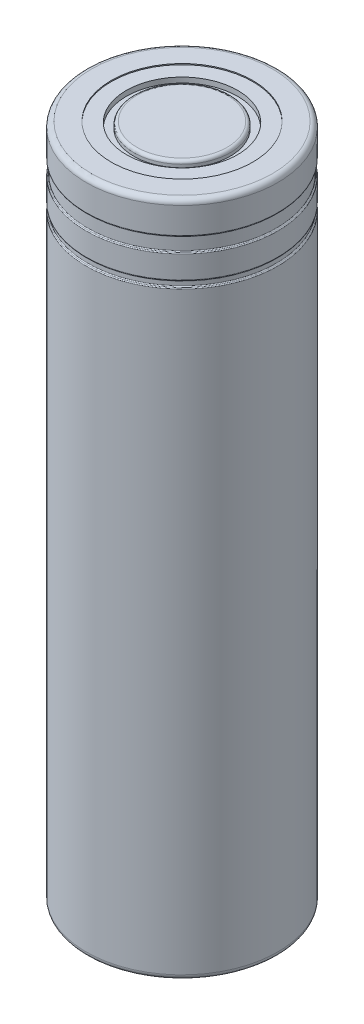
ISO-10303-21;
HEADER;
FILE_DESCRIPTION(('STEP AP214'),'2;1');
FILE_NAME('part.step','',(''),(''),'','','');
FILE_SCHEMA(('AUTOMOTIVE_DESIGN { 1 0 10303 214 1 1 1 1 }'));
ENDSEC;
DATA;
#1=APPLICATION_CONTEXT('core data for automotive mechanical design processes');
#2=APPLICATION_PROTOCOL_DEFINITION('international standard','automotive_design',2000,#1);
#3=PRODUCT_CONTEXT('',#1,'mechanical');
#4=PRODUCT('Part','Part','',(#3));
#5=PRODUCT_RELATED_PRODUCT_CATEGORY('part','',(#4));
#6=PRODUCT_DEFINITION_FORMATION('','',#4);
#7=PRODUCT_DEFINITION_CONTEXT('part definition',#1,'design');
#8=PRODUCT_DEFINITION('design','',#6,#7);
#9=PRODUCT_DEFINITION_SHAPE('','',#8);
#10=(LENGTH_UNIT() NAMED_UNIT(*) SI_UNIT(.MILLI.,.METRE.));
#11=(NAMED_UNIT(*) PLANE_ANGLE_UNIT() SI_UNIT($,.RADIAN.));
#12=(NAMED_UNIT(*) SI_UNIT($,.STERADIAN.) SOLID_ANGLE_UNIT());
#13=UNCERTAINTY_MEASURE_WITH_UNIT(LENGTH_MEASURE(1.E-05),#10,'distance_accuracy_value','');
#14=(GEOMETRIC_REPRESENTATION_CONTEXT(3) GLOBAL_UNCERTAINTY_ASSIGNED_CONTEXT((#13)) GLOBAL_UNIT_ASSIGNED_CONTEXT((#10,
#11,#12)) REPRESENTATION_CONTEXT('',''));
#15=CARTESIAN_POINT('',(0.,0.,0.));
#16=DIRECTION('',(0.,0.,1.));
#17=DIRECTION('',(1.,0.,0.));
#18=AXIS2_PLACEMENT_3D('',#15,#16,#17);
#19=CARTESIAN_POINT('',(0.,64.9,0.));
#20=DIRECTION('',(0.,-1.,0.));
#21=DIRECTION('',(1.,0.,0.));
#22=AXIS2_PLACEMENT_3D('',#19,#20,#21);
#23=PLANE('',#22);
#24=CARTESIAN_POINT('',(0.,64.9,0.));
#25=DIRECTION('',(0.,1.,0.));
#26=DIRECTION('',(-1.,0.,0.));
#27=AXIS2_PLACEMENT_3D('',#24,#25,#26);
#28=CIRCLE('',#27,8.7);
#29=CARTESIAN_POINT('',(8.69999999999999,64.9,0.));
#30=VERTEX_POINT('',#29);
#31=CARTESIAN_POINT('',(-8.70000000000002,64.9,0.));
#32=VERTEX_POINT('',#31);
#33=EDGE_CURVE('P0_E58',#30,#32,#28,.F.);
#34=ORIENTED_EDGE('',*,*,#33,.T.);
#35=CARTESIAN_POINT('',(0.,64.9,0.));
#36=DIRECTION('',(0.,1.,0.));
#37=DIRECTION('',(1.,0.,0.));
#38=AXIS2_PLACEMENT_3D('',#35,#36,#37);
#39=CIRCLE('',#38,8.7);
#40=EDGE_CURVE('P0_E55',#32,#30,#39,.F.);
#41=ORIENTED_EDGE('',*,*,#40,.T.);
#42=EDGE_LOOP('',(#34,#41));
#43=FACE_BOUND('',#42,.T.);
#44=CARTESIAN_POINT('',(0.,64.9,0.));
#45=DIRECTION('',(0.,1.,0.));
#46=DIRECTION('',(-1.,0.,0.));
#47=AXIS2_PLACEMENT_3D('',#44,#45,#46);
#48=CIRCLE('',#47,6.80000000000001);
#49=CARTESIAN_POINT('',(-6.80000000000003,64.9,0.));
#50=VERTEX_POINT('',#49);
#51=EDGE_CURVE('P0_E63',#50,#50,#48,.T.);
#52=ORIENTED_EDGE('',*,*,#51,.T.);
#53=EDGE_LOOP('',(#52));
#54=FACE_BOUND('',#53,.T.);
#55=ADVANCED_FACE('P0_F15',(#43,#54),#23,.T.);
#56=CARTESIAN_POINT('',(0.,64.5,0.));
#57=DIRECTION('',(0.,1.,0.));
#58=DIRECTION('',(-1.,0.,0.));
#59=AXIS2_PLACEMENT_3D('',#56,#57,#58);
#60=TOROIDAL_SURFACE('',#59,8.7,0.399999999999999);
#61=CARTESIAN_POINT('',(0.,64.5,0.));
#62=DIRECTION('',(0.,1.,0.));
#63=DIRECTION('',(-1.,0.,0.));
#64=AXIS2_PLACEMENT_3D('',#61,#62,#63);
#65=CIRCLE('',#64,9.1);
#66=CARTESIAN_POINT('',(-9.10000000000002,64.5,0.));
#67=VERTEX_POINT('',#66);
#68=EDGE_CURVE('P0_E142',#67,#67,#65,.F.);
#69=ORIENTED_EDGE('',*,*,#68,.T.);
#70=EDGE_LOOP('',(#69));
#71=FACE_BOUND('',#70,.T.);
#72=ORIENTED_EDGE('',*,*,#40,.F.);
#73=ORIENTED_EDGE('',*,*,#33,.F.);
#74=EDGE_LOOP('',(#72,#73));
#75=FACE_BOUND('',#74,.T.);
#76=ADVANCED_FACE('P0_F66',(#71,#75),#60,.F.);
#77=CARTESIAN_POINT('',(0.,0.,0.));
#78=DIRECTION('',(0.,1.,0.));
#79=DIRECTION('',(-1.,0.,0.));
#80=AXIS2_PLACEMENT_3D('',#77,#78,#79);
#81=CYLINDRICAL_SURFACE('',#80,6.80000000000001);
#82=ORIENTED_EDGE('',*,*,#51,.F.);
#83=EDGE_LOOP('',(#82));
#84=FACE_BOUND('',#83,.T.);
#85=CARTESIAN_POINT('',(0.,65.,0.));
#86=DIRECTION('',(0.,1.,0.));
#87=DIRECTION('',(-1.,0.,0.));
#88=AXIS2_PLACEMENT_3D('',#85,#86,#87);
#89=CIRCLE('',#88,6.80000000000001);
#90=CARTESIAN_POINT('',(-6.80000000000003,65.,0.));
#91=VERTEX_POINT('',#90);
#92=EDGE_CURVE('P0_E144',#91,#91,#89,.T.);
#93=ORIENTED_EDGE('',*,*,#92,.T.);
#94=EDGE_LOOP('',(#93));
#95=FACE_BOUND('',#94,.T.);
#96=ADVANCED_FACE('P0_F148',(#84,#95),#81,.F.);
#97=CARTESIAN_POINT('',(0.,0.,0.));
#98=DIRECTION('',(0.,1.,0.));
#99=DIRECTION('',(-1.,0.,0.));
#100=AXIS2_PLACEMENT_3D('',#97,#98,#99);
#101=CYLINDRICAL_SURFACE('',#100,9.1);
#102=CARTESIAN_POINT('',(0.,61.9999999999998,0.));
#103=DIRECTION('',(0.,1.,0.));
#104=DIRECTION('',(-1.,0.,0.));
#105=AXIS2_PLACEMENT_3D('',#102,#103,#104);
#106=CIRCLE('',#105,9.10000000000007);
#107=CARTESIAN_POINT('',(-9.10000000000008,61.9999999999998,0.));
#108=VERTEX_POINT('',#107);
#109=EDGE_CURVE('P0_E134',#108,#108,#106,.T.);
#110=ORIENTED_EDGE('',*,*,#109,.F.);
#111=EDGE_LOOP('',(#110));
#112=FACE_BOUND('',#111,.T.);
#113=ORIENTED_EDGE('',*,*,#68,.F.);
#114=EDGE_LOOP('',(#113));
#115=FACE_BOUND('',#114,.T.);
#116=ADVANCED_FACE('P0_F120',(#112,#115),#101,.F.);
#117=CARTESIAN_POINT('',(0.,65.,0.));
#118=DIRECTION('',(0.,-1.,0.));
#119=DIRECTION('',(1.,0.,0.));
#120=AXIS2_PLACEMENT_3D('',#117,#118,#119);
#121=PLANE('',#120);
#122=CARTESIAN_POINT('',(0.,65.,0.));
#123=DIRECTION('',(0.,-1.,0.));
#124=DIRECTION('',(-1.,0.,0.));
#125=AXIS2_PLACEMENT_3D('',#122,#123,#124);
#126=CIRCLE('',#125,8.7);
#127=CARTESIAN_POINT('',(-8.70000000000002,65.,0.));
#128=VERTEX_POINT('',#127);
#129=CARTESIAN_POINT('',(8.69999999999999,65.,0.));
#130=VERTEX_POINT('',#129);
#131=EDGE_CURVE('P0_E105',#128,#130,#126,.T.);
#132=ORIENTED_EDGE('',*,*,#131,.F.);
#133=CARTESIAN_POINT('',(0.,65.,0.));
#134=DIRECTION('',(0.,-1.,0.));
#135=DIRECTION('',(1.,0.,0.));
#136=AXIS2_PLACEMENT_3D('',#133,#134,#135);
#137=CIRCLE('',#136,8.7);
#138=EDGE_CURVE('P0_E99',#130,#128,#137,.T.);
#139=ORIENTED_EDGE('',*,*,#138,.F.);
#140=EDGE_LOOP('',(#132,#139));
#141=FACE_BOUND('',#140,.T.);
#142=ORIENTED_EDGE('',*,*,#92,.F.);
#143=EDGE_LOOP('',(#142));
#144=FACE_BOUND('',#143,.T.);
#145=ADVANCED_FACE('P0_F111',(#141,#144),#121,.F.);
#146=CARTESIAN_POINT('',(0.,61.8092121597162,0.));
#147=DIRECTION('',(0.,1.,0.));
#148=DIRECTION('',(-1.,0.,0.));
#149=AXIS2_PLACEMENT_3D('',#146,#147,#148);
#150=TOROIDAL_SURFACE('',#149,9.1600000000003,0.200000000000288);
#151=CARTESIAN_POINT('',(0.,61.8092121597162,0.));
#152=DIRECTION('',(0.,1.,0.));
#153=DIRECTION('',(-1.,0.,0.));
#154=AXIS2_PLACEMENT_3D('',#151,#152,#153);
#155=CIRCLE('',#154,8.96000000000001);
#156=CARTESIAN_POINT('',(-8.96000000000002,61.8092121597162,0.));
#157=VERTEX_POINT('',#156);
#158=EDGE_CURVE('P0_E97',#157,#157,#155,.F.);
#159=ORIENTED_EDGE('',*,*,#158,.T.);
#160=EDGE_LOOP('',(#159));
#161=FACE_BOUND('',#160,.T.);
#162=ORIENTED_EDGE('',*,*,#109,.T.);
#163=EDGE_LOOP('',(#162));
#164=FACE_BOUND('',#163,.T.);
#165=ADVANCED_FACE('P0_F85',(#161,#164),#150,.T.);
#166=CARTESIAN_POINT('',(0.,64.5,0.));
#167=DIRECTION('',(0.,1.,0.));
#168=DIRECTION('',(-1.,0.,0.));
#169=AXIS2_PLACEMENT_3D('',#166,#167,#168);
#170=TOROIDAL_SURFACE('',#169,8.7,0.500000000000001);
#171=ORIENTED_EDGE('',*,*,#131,.T.);
#172=ORIENTED_EDGE('',*,*,#138,.T.);
#173=EDGE_LOOP('',(#171,#172));
#174=FACE_BOUND('',#173,.T.);
#175=CARTESIAN_POINT('',(0.,64.5,0.));
#176=DIRECTION('',(0.,1.,0.));
#177=DIRECTION('',(-1.,0.,0.));
#178=AXIS2_PLACEMENT_3D('',#175,#176,#177);
#179=CIRCLE('',#178,9.20000000000001);
#180=CARTESIAN_POINT('',(-9.20000000000002,64.5,0.));
#181=VERTEX_POINT('',#180);
#182=EDGE_CURVE('P0_E95',#181,#181,#179,.F.);
#183=ORIENTED_EDGE('',*,*,#182,.F.);
#184=EDGE_LOOP('',(#183));
#185=FACE_BOUND('',#184,.T.);
#186=ADVANCED_FACE('P0_F73',(#174,#185),#170,.T.);
#187=CARTESIAN_POINT('',(0.,0.,0.));
#188=DIRECTION('',(0.,1.,0.));
#189=DIRECTION('',(-1.,0.,0.));
#190=AXIS2_PLACEMENT_3D('',#187,#188,#189);
#191=CYLINDRICAL_SURFACE('',#190,8.96000000000001);
#192=CARTESIAN_POINT('',(0.,60.6507878402838,0.));
#193=DIRECTION('',(0.,1.,0.));
#194=DIRECTION('',(-1.,0.,0.));
#195=AXIS2_PLACEMENT_3D('',#192,#193,#194);
#196=CIRCLE('',#195,8.96000000000001);
#197=CARTESIAN_POINT('',(-8.96000000000003,60.6507878402838,0.));
#198=VERTEX_POINT('',#197);
#199=EDGE_CURVE('P0_E372',#198,#198,#196,.T.);
#200=ORIENTED_EDGE('',*,*,#199,.F.);
#201=EDGE_LOOP('',(#200));
#202=FACE_BOUND('',#201,.T.);
#203=ORIENTED_EDGE('',*,*,#158,.F.);
#204=EDGE_LOOP('',(#203));
#205=FACE_BOUND('',#204,.T.);
#206=ADVANCED_FACE('P0_F84',(#202,#205),#191,.F.);
#207=CARTESIAN_POINT('',(0.,0.,0.));
#208=DIRECTION('',(0.,1.,0.));
#209=DIRECTION('',(-1.,0.,0.));
#210=AXIS2_PLACEMENT_3D('',#207,#208,#209);
#211=CYLINDRICAL_SURFACE('',#210,9.20000000000001);
#212=ORIENTED_EDGE('',*,*,#182,.T.);
#213=EDGE_LOOP('',(#212));
#214=FACE_BOUND('',#213,.T.);
#215=CARTESIAN_POINT('',(0.,62.,0.));
#216=DIRECTION('',(0.,1.,0.));
#217=DIRECTION('',(-1.,0.,0.));
#218=AXIS2_PLACEMENT_3D('',#215,#216,#217);
#219=CIRCLE('',#218,9.2);
#220=CARTESIAN_POINT('',(-9.20000000000002,62.,0.));
#221=VERTEX_POINT('',#220);
#222=EDGE_CURVE('P0_E370',#221,#221,#219,.F.);
#223=ORIENTED_EDGE('',*,*,#222,.F.);
#224=EDGE_LOOP('',(#223));
#225=FACE_BOUND('',#224,.T.);
#226=ADVANCED_FACE('P0_F366',(#214,#225),#211,.T.);
#227=CARTESIAN_POINT('',(0.,60.6507878402838,0.));
#228=DIRECTION('',(0.,1.,0.));
#229=DIRECTION('',(-1.,0.,0.));
#230=AXIS2_PLACEMENT_3D('',#227,#228,#229);
#231=TOROIDAL_SURFACE('',#230,9.1600000000003,0.200000000000286);
#232=CARTESIAN_POINT('',(0.,60.46,0.));
#233=DIRECTION('',(0.,1.,0.));
#234=DIRECTION('',(-1.,0.,0.));
#235=AXIS2_PLACEMENT_3D('',#232,#233,#234);
#236=CIRCLE('',#235,9.10000000000001);
#237=CARTESIAN_POINT('',(-9.10000000000002,60.46,0.));
#238=VERTEX_POINT('',#237);
#239=EDGE_CURVE('P0_E356',#238,#238,#236,.F.);
#240=ORIENTED_EDGE('',*,*,#239,.T.);
#241=EDGE_LOOP('',(#240));
#242=FACE_BOUND('',#241,.T.);
#243=ORIENTED_EDGE('',*,*,#199,.T.);
#244=EDGE_LOOP('',(#243));
#245=FACE_BOUND('',#244,.T.);
#246=ADVANCED_FACE('P0_F363',(#242,#245),#231,.T.);
#247=CARTESIAN_POINT('',(0.,62.,0.));
#248=DIRECTION('',(0.,1.,0.));
#249=DIRECTION('',(-1.,0.,0.));
#250=AXIS2_PLACEMENT_3D('',#247,#248,#249);
#251=TOROIDAL_SURFACE('',#250,9.09999999999972,0.100000000000288);
#252=ORIENTED_EDGE('',*,*,#222,.T.);
#253=EDGE_LOOP('',(#252));
#254=FACE_BOUND('',#253,.T.);
#255=CARTESIAN_POINT('',(0.,61.9046060798581,0.));
#256=DIRECTION('',(0.,1.,0.));
#257=DIRECTION('',(-1.,0.,0.));
#258=AXIS2_PLACEMENT_3D('',#255,#256,#257);
#259=CIRCLE('',#258,9.13000000000001);
#260=CARTESIAN_POINT('',(-9.13000000000003,61.9046060798581,0.));
#261=VERTEX_POINT('',#260);
#262=EDGE_CURVE('P0_E353',#261,#261,#259,.T.);
#263=ORIENTED_EDGE('',*,*,#262,.T.);
#264=EDGE_LOOP('',(#263));
#265=FACE_BOUND('',#264,.T.);
#266=ADVANCED_FACE('P0_F360',(#254,#265),#251,.T.);
#267=CARTESIAN_POINT('',(0.,0.,0.));
#268=DIRECTION('',(0.,1.,0.));
#269=DIRECTION('',(-1.,0.,0.));
#270=AXIS2_PLACEMENT_3D('',#267,#268,#269);
#271=CYLINDRICAL_SURFACE('',#270,9.10000000000001);
#272=CARTESIAN_POINT('',(0.,58.2999999999998,0.));
#273=DIRECTION('',(0.,1.,0.));
#274=DIRECTION('',(-1.,0.,0.));
#275=AXIS2_PLACEMENT_3D('',#272,#273,#274);
#276=CIRCLE('',#275,9.10000000000007);
#277=CARTESIAN_POINT('',(-9.10000000000008,58.2999999999998,0.));
#278=VERTEX_POINT('',#277);
#279=EDGE_CURVE('P0_E350',#278,#278,#276,.T.);
#280=ORIENTED_EDGE('',*,*,#279,.F.);
#281=EDGE_LOOP('',(#280));
#282=FACE_BOUND('',#281,.T.);
#283=ORIENTED_EDGE('',*,*,#239,.F.);
#284=EDGE_LOOP('',(#283));
#285=FACE_BOUND('',#284,.T.);
#286=ADVANCED_FACE('P0_F345',(#282,#285),#271,.F.);
#287=CARTESIAN_POINT('',(0.,61.8092121597162,0.));
#288=DIRECTION('',(0.,1.,0.));
#289=DIRECTION('',(-1.,0.,0.));
#290=AXIS2_PLACEMENT_3D('',#287,#288,#289);
#291=TOROIDAL_SURFACE('',#290,9.1600000000003,0.100000000000288);
#292=ORIENTED_EDGE('',*,*,#262,.F.);
#293=EDGE_LOOP('',(#292));
#294=FACE_BOUND('',#293,.T.);
#295=CARTESIAN_POINT('',(0.,61.8092121597162,0.));
#296=DIRECTION('',(0.,1.,0.));
#297=DIRECTION('',(-1.,0.,0.));
#298=AXIS2_PLACEMENT_3D('',#295,#296,#297);
#299=CIRCLE('',#298,9.06000000000001);
#300=CARTESIAN_POINT('',(-9.06000000000003,61.8092121597162,0.));
#301=VERTEX_POINT('',#300);
#302=EDGE_CURVE('P0_E331',#301,#301,#299,.F.);
#303=ORIENTED_EDGE('',*,*,#302,.F.);
#304=EDGE_LOOP('',(#303));
#305=FACE_BOUND('',#304,.T.);
#306=ADVANCED_FACE('P0_F341',(#294,#305),#291,.F.);
#307=CARTESIAN_POINT('',(0.,58.1092121597162,0.));
#308=DIRECTION('',(0.,1.,0.));
#309=DIRECTION('',(-1.,0.,0.));
#310=AXIS2_PLACEMENT_3D('',#307,#308,#309);
#311=TOROIDAL_SURFACE('',#310,9.1600000000003,0.200000000000295);
#312=CARTESIAN_POINT('',(0.,58.1092121597162,0.));
#313=DIRECTION('',(0.,1.,0.));
#314=DIRECTION('',(-1.,0.,0.));
#315=AXIS2_PLACEMENT_3D('',#312,#313,#314);
#316=CIRCLE('',#315,8.96000000000001);
#317=CARTESIAN_POINT('',(-8.96000000000002,58.1092121597162,0.));
#318=VERTEX_POINT('',#317);
#319=EDGE_CURVE('P0_E328',#318,#318,#316,.F.);
#320=ORIENTED_EDGE('',*,*,#319,.T.);
#321=EDGE_LOOP('',(#320));
#322=FACE_BOUND('',#321,.T.);
#323=ORIENTED_EDGE('',*,*,#279,.T.);
#324=EDGE_LOOP('',(#323));
#325=FACE_BOUND('',#324,.T.);
#326=ADVANCED_FACE('P0_F336',(#322,#325),#311,.T.);
#327=CARTESIAN_POINT('',(0.,0.,0.));
#328=DIRECTION('',(0.,1.,0.));
#329=DIRECTION('',(-1.,0.,0.));
#330=AXIS2_PLACEMENT_3D('',#327,#328,#329);
#331=CYLINDRICAL_SURFACE('',#330,9.06000000000001);
#332=ORIENTED_EDGE('',*,*,#302,.T.);
#333=EDGE_LOOP('',(#332));
#334=FACE_BOUND('',#333,.T.);
#335=CARTESIAN_POINT('',(0.,60.6507878402838,0.));
#336=DIRECTION('',(0.,1.,0.));
#337=DIRECTION('',(-1.,0.,0.));
#338=AXIS2_PLACEMENT_3D('',#335,#336,#337);
#339=CIRCLE('',#338,9.06000000000001);
#340=CARTESIAN_POINT('',(-9.06000000000003,60.6507878402838,0.));
#341=VERTEX_POINT('',#340);
#342=EDGE_CURVE('P0_E325',#341,#341,#339,.T.);
#343=ORIENTED_EDGE('',*,*,#342,.T.);
#344=EDGE_LOOP('',(#343));
#345=FACE_BOUND('',#344,.T.);
#346=ADVANCED_FACE('P0_F340',(#334,#345),#331,.T.);
#347=CARTESIAN_POINT('',(0.,0.,0.));
#348=DIRECTION('',(0.,1.,0.));
#349=DIRECTION('',(-1.,0.,0.));
#350=AXIS2_PLACEMENT_3D('',#347,#348,#349);
#351=CYLINDRICAL_SURFACE('',#350,8.96000000000001);
#352=CARTESIAN_POINT('',(0.,57.7307878402838,0.));
#353=DIRECTION('',(0.,1.,0.));
#354=DIRECTION('',(-1.,0.,0.));
#355=AXIS2_PLACEMENT_3D('',#352,#353,#354);
#356=CIRCLE('',#355,8.96000000000001);
#357=CARTESIAN_POINT('',(-8.96000000000002,57.7307878402838,0.));
#358=VERTEX_POINT('',#357);
#359=EDGE_CURVE('P0_E320',#358,#358,#356,.T.);
#360=ORIENTED_EDGE('',*,*,#359,.F.);
#361=EDGE_LOOP('',(#360));
#362=FACE_BOUND('',#361,.T.);
#363=ORIENTED_EDGE('',*,*,#319,.F.);
#364=EDGE_LOOP('',(#363));
#365=FACE_BOUND('',#364,.T.);
#366=ADVANCED_FACE('P0_F391',(#362,#365),#351,.F.);
#367=CARTESIAN_POINT('',(0.,60.6507878402838,0.));
#368=DIRECTION('',(0.,1.,0.));
#369=DIRECTION('',(-1.,0.,0.));
#370=AXIS2_PLACEMENT_3D('',#367,#368,#369);
#371=TOROIDAL_SURFACE('',#370,9.1600000000003,0.100000000000287);
#372=ORIENTED_EDGE('',*,*,#342,.F.);
#373=EDGE_LOOP('',(#372));
#374=FACE_BOUND('',#373,.T.);
#375=CARTESIAN_POINT('',(0.,60.5553939201419,0.));
#376=DIRECTION('',(0.,1.,0.));
#377=DIRECTION('',(-1.,0.,0.));
#378=AXIS2_PLACEMENT_3D('',#375,#376,#377);
#379=CIRCLE('',#378,9.13000000000001);
#380=CARTESIAN_POINT('',(-9.13000000000003,60.5553939201419,0.));
#381=VERTEX_POINT('',#380);
#382=EDGE_CURVE('P0_E318',#381,#381,#379,.F.);
#383=ORIENTED_EDGE('',*,*,#382,.F.);
#384=EDGE_LOOP('',(#383));
#385=FACE_BOUND('',#384,.T.);
#386=ADVANCED_FACE('P0_F312',(#374,#385),#371,.F.);
#387=CARTESIAN_POINT('',(0.,57.7307878402838,0.));
#388=DIRECTION('',(0.,1.,0.));
#389=DIRECTION('',(-1.,0.,0.));
#390=AXIS2_PLACEMENT_3D('',#387,#388,#389);
#391=TOROIDAL_SURFACE('',#390,9.16000000000031,0.200000000000297);
#392=CARTESIAN_POINT('',(0.,57.54,0.));
#393=DIRECTION('',(0.,1.,0.));
#394=DIRECTION('',(-1.,0.,0.));
#395=AXIS2_PLACEMENT_3D('',#392,#393,#394);
#396=CIRCLE('',#395,9.1);
#397=CARTESIAN_POINT('',(-9.10000000000001,57.54,0.));
#398=VERTEX_POINT('',#397);
#399=EDGE_CURVE('P0_E297',#398,#398,#396,.F.);
#400=ORIENTED_EDGE('',*,*,#399,.T.);
#401=EDGE_LOOP('',(#400));
#402=FACE_BOUND('',#401,.T.);
#403=ORIENTED_EDGE('',*,*,#359,.T.);
#404=EDGE_LOOP('',(#403));
#405=FACE_BOUND('',#404,.T.);
#406=ADVANCED_FACE('P0_F307',(#402,#405),#391,.T.);
#407=CARTESIAN_POINT('',(0.,60.46,0.));
#408=DIRECTION('',(0.,1.,0.));
#409=DIRECTION('',(-1.,0.,0.));
#410=AXIS2_PLACEMENT_3D('',#407,#408,#409);
#411=TOROIDAL_SURFACE('',#410,9.09999999999972,0.100000000000289);
#412=ORIENTED_EDGE('',*,*,#382,.T.);
#413=EDGE_LOOP('',(#412));
#414=FACE_BOUND('',#413,.T.);
#415=CARTESIAN_POINT('',(0.,60.46,0.));
#416=DIRECTION('',(0.,1.,0.));
#417=DIRECTION('',(-1.,0.,0.));
#418=AXIS2_PLACEMENT_3D('',#415,#416,#417);
#419=CIRCLE('',#418,9.20000000000001);
#420=CARTESIAN_POINT('',(-9.20000000000002,60.46,0.));
#421=VERTEX_POINT('',#420);
#422=EDGE_CURVE('P0_E289',#421,#421,#419,.F.);
#423=ORIENTED_EDGE('',*,*,#422,.F.);
#424=EDGE_LOOP('',(#423));
#425=FACE_BOUND('',#424,.T.);
#426=ADVANCED_FACE('P0_F302',(#414,#425),#411,.T.);
#427=CARTESIAN_POINT('',(0.,0.,0.));
#428=DIRECTION('',(0.,1.,0.));
#429=DIRECTION('',(-1.,0.,0.));
#430=AXIS2_PLACEMENT_3D('',#427,#428,#429);
#431=CYLINDRICAL_SURFACE('',#430,9.1);
#432=CARTESIAN_POINT('',(0.,0.499999999999998,0.));
#433=DIRECTION('',(0.,1.,0.));
#434=DIRECTION('',(-1.,0.,0.));
#435=AXIS2_PLACEMENT_3D('',#432,#433,#434);
#436=CIRCLE('',#435,9.09999999999999);
#437=CARTESIAN_POINT('',(-9.09999999999999,0.499999999999996,0.));
#438=VERTEX_POINT('',#437);
#439=EDGE_CURVE('P0_E284',#438,#438,#436,.F.);
#440=ORIENTED_EDGE('',*,*,#439,.T.);
#441=EDGE_LOOP('',(#440));
#442=FACE_BOUND('',#441,.T.);
#443=ORIENTED_EDGE('',*,*,#399,.F.);
#444=EDGE_LOOP('',(#443));
#445=FACE_BOUND('',#444,.T.);
#446=ADVANCED_FACE('P0_F306',(#442,#445),#431,.F.);
#447=CARTESIAN_POINT('',(0.,0.,0.));
#448=DIRECTION('',(0.,1.,0.));
#449=DIRECTION('',(-1.,0.,0.));
#450=AXIS2_PLACEMENT_3D('',#447,#448,#449);
#451=CYLINDRICAL_SURFACE('',#450,9.20000000000001);
#452=ORIENTED_EDGE('',*,*,#422,.T.);
#453=EDGE_LOOP('',(#452));
#454=FACE_BOUND('',#453,.T.);
#455=CARTESIAN_POINT('',(0.,58.3,0.));
#456=DIRECTION('',(0.,1.,0.));
#457=DIRECTION('',(-1.,0.,0.));
#458=AXIS2_PLACEMENT_3D('',#455,#456,#457);
#459=CIRCLE('',#458,9.20000000000001);
#460=CARTESIAN_POINT('',(-9.20000000000002,58.3,0.));
#461=VERTEX_POINT('',#460);
#462=EDGE_CURVE('P0_E282',#461,#461,#459,.F.);
#463=ORIENTED_EDGE('',*,*,#462,.F.);
#464=EDGE_LOOP('',(#463));
#465=FACE_BOUND('',#464,.T.);
#466=ADVANCED_FACE('P0_F400',(#454,#465),#451,.T.);
#467=CARTESIAN_POINT('',(0.,0.499999999999998,0.));
#468=DIRECTION('',(0.,1.,0.));
#469=DIRECTION('',(-1.,0.,0.));
#470=AXIS2_PLACEMENT_3D('',#467,#468,#469);
#471=TOROIDAL_SURFACE('',#470,8.69999999999999,0.4);
#472=CARTESIAN_POINT('',(0.,0.0999999999999988,0.));
#473=DIRECTION('',(0.,-1.,0.));
#474=DIRECTION('',(1.,0.,0.));
#475=AXIS2_PLACEMENT_3D('',#472,#473,#474);
#476=CIRCLE('',#475,8.69999999999999);
#477=CARTESIAN_POINT('',(8.69999999999999,0.100000000000001,0.));
#478=VERTEX_POINT('',#477);
#479=CARTESIAN_POINT('',(-8.69999999999999,0.0999999999999971,0.));
#480=VERTEX_POINT('',#479);
#481=EDGE_CURVE('P0_E276',#478,#480,#476,.T.);
#482=ORIENTED_EDGE('',*,*,#481,.T.);
#483=CARTESIAN_POINT('',(0.,0.0999999999999988,0.));
#484=DIRECTION('',(0.,-1.,0.));
#485=DIRECTION('',(-1.,0.,0.));
#486=AXIS2_PLACEMENT_3D('',#483,#484,#485);
#487=CIRCLE('',#486,8.69999999999999);
#488=EDGE_CURVE('P0_E278',#480,#478,#487,.T.);
#489=ORIENTED_EDGE('',*,*,#488,.T.);
#490=EDGE_LOOP('',(#482,#489));
#491=FACE_BOUND('',#490,.T.);
#492=ORIENTED_EDGE('',*,*,#439,.F.);
#493=EDGE_LOOP('',(#492));
#494=FACE_BOUND('',#493,.T.);
#495=ADVANCED_FACE('P0_F403',(#491,#494),#471,.F.);
#496=CARTESIAN_POINT('',(0.,58.3,0.));
#497=DIRECTION('',(0.,1.,0.));
#498=DIRECTION('',(-1.,0.,0.));
#499=AXIS2_PLACEMENT_3D('',#496,#497,#498);
#500=TOROIDAL_SURFACE('',#499,9.09999999999972,0.100000000000287);
#501=ORIENTED_EDGE('',*,*,#462,.T.);
#502=EDGE_LOOP('',(#501));
#503=FACE_BOUND('',#502,.T.);
#504=CARTESIAN_POINT('',(0.,58.2046060798581,0.));
#505=DIRECTION('',(0.,1.,0.));
#506=DIRECTION('',(-1.,0.,0.));
#507=AXIS2_PLACEMENT_3D('',#504,#505,#506);
#508=CIRCLE('',#507,9.13000000000001);
#509=CARTESIAN_POINT('',(-9.13000000000002,58.2046060798581,0.));
#510=VERTEX_POINT('',#509);
#511=EDGE_CURVE('P0_E169',#510,#510,#508,.T.);
#512=ORIENTED_EDGE('',*,*,#511,.T.);
#513=EDGE_LOOP('',(#512));
#514=FACE_BOUND('',#513,.T.);
#515=ADVANCED_FACE('P0_F258',(#503,#514),#500,.T.);
#516=CARTESIAN_POINT('',(0.,0.0999999999999997,0.));
#517=DIRECTION('',(0.,-1.,0.));
#518=DIRECTION('',(1.,0.,0.));
#519=AXIS2_PLACEMENT_3D('',#516,#517,#518);
#520=PLANE('',#519);
#521=ORIENTED_EDGE('',*,*,#488,.F.);
#522=ORIENTED_EDGE('',*,*,#481,.F.);
#523=EDGE_LOOP('',(#521,#522));
#524=FACE_BOUND('',#523,.T.);
#525=CARTESIAN_POINT('',(0.,0.100000000000003,0.));
#526=DIRECTION('',(0.,1.,0.));
#527=DIRECTION('',(-1.,0.,0.));
#528=AXIS2_PLACEMENT_3D('',#525,#526,#527);
#529=CIRCLE('',#528,7.9);
#530=CARTESIAN_POINT('',(-7.9,0.100000000000001,0.));
#531=VERTEX_POINT('',#530);
#532=EDGE_CURVE('P0_E166',#531,#531,#529,.F.);
#533=ORIENTED_EDGE('',*,*,#532,.T.);
#534=EDGE_LOOP('',(#533));
#535=FACE_BOUND('',#534,.T.);
#536=ADVANCED_FACE('P0_F253',(#524,#535),#520,.F.);
#537=CARTESIAN_POINT('',(0.,58.1092121597162,0.));
#538=DIRECTION('',(0.,1.,0.));
#539=DIRECTION('',(-1.,0.,0.));
#540=AXIS2_PLACEMENT_3D('',#537,#538,#539);
#541=TOROIDAL_SURFACE('',#540,9.1600000000003,0.100000000000291);
#542=ORIENTED_EDGE('',*,*,#511,.F.);
#543=EDGE_LOOP('',(#542));
#544=FACE_BOUND('',#543,.T.);
#545=CARTESIAN_POINT('',(0.,58.1092121597162,0.));
#546=DIRECTION('',(0.,1.,0.));
#547=DIRECTION('',(-1.,0.,0.));
#548=AXIS2_PLACEMENT_3D('',#545,#546,#547);
#549=CIRCLE('',#548,9.06000000000001);
#550=CARTESIAN_POINT('',(-9.06000000000002,58.1092121597162,0.));
#551=VERTEX_POINT('',#550);
#552=EDGE_CURVE('P0_E165',#551,#551,#549,.F.);
#553=ORIENTED_EDGE('',*,*,#552,.F.);
#554=EDGE_LOOP('',(#553));
#555=FACE_BOUND('',#554,.T.);
#556=ADVANCED_FACE('P0_F249',(#544,#555),#541,.F.);
#557=CARTESIAN_POINT('',(0.,0.,0.));
#558=DIRECTION('',(0.,1.,0.));
#559=DIRECTION('',(-1.,0.,0.));
#560=AXIS2_PLACEMENT_3D('',#557,#558,#559);
#561=CYLINDRICAL_SURFACE('',#560,7.9);
#562=ORIENTED_EDGE('',*,*,#532,.F.);
#563=EDGE_LOOP('',(#562));
#564=FACE_BOUND('',#563,.T.);
#565=CARTESIAN_POINT('',(0.,0.,0.));
#566=DIRECTION('',(0.,1.,0.));
#567=DIRECTION('',(-1.,0.,0.));
#568=AXIS2_PLACEMENT_3D('',#565,#566,#567);
#569=CIRCLE('',#568,7.9);
#570=CARTESIAN_POINT('',(-7.9,0.,0.));
#571=VERTEX_POINT('',#570);
#572=EDGE_CURVE('P0_E156',#571,#571,#569,.T.);
#573=ORIENTED_EDGE('',*,*,#572,.F.);
#574=EDGE_LOOP('',(#573));
#575=FACE_BOUND('',#574,.T.);
#576=ADVANCED_FACE('P0_F252',(#564,#575),#561,.F.);
#577=CARTESIAN_POINT('',(0.,0.,0.));
#578=DIRECTION('',(0.,1.,0.));
#579=DIRECTION('',(-1.,0.,0.));
#580=AXIS2_PLACEMENT_3D('',#577,#578,#579);
#581=CYLINDRICAL_SURFACE('',#580,9.06000000000001);
#582=ORIENTED_EDGE('',*,*,#552,.T.);
#583=EDGE_LOOP('',(#582));
#584=FACE_BOUND('',#583,.T.);
#585=CARTESIAN_POINT('',(0.,57.7307878402838,0.));
#586=DIRECTION('',(0.,1.,0.));
#587=DIRECTION('',(-1.,0.,0.));
#588=AXIS2_PLACEMENT_3D('',#585,#586,#587);
#589=CIRCLE('',#588,9.06000000000001);
#590=CARTESIAN_POINT('',(-9.06000000000002,57.7307878402838,0.));
#591=VERTEX_POINT('',#590);
#592=EDGE_CURVE('P0_E164',#591,#591,#589,.T.);
#593=ORIENTED_EDGE('',*,*,#592,.T.);
#594=EDGE_LOOP('',(#593));
#595=FACE_BOUND('',#594,.T.);
#596=ADVANCED_FACE('P0_F221',(#584,#595),#581,.T.);
#597=CARTESIAN_POINT('',(0.,0.,0.));
#598=DIRECTION('',(0.,-1.,0.));
#599=DIRECTION('',(1.,0.,0.));
#600=AXIS2_PLACEMENT_3D('',#597,#598,#599);
#601=PLANE('',#600);
#602=CARTESIAN_POINT('',(0.,0.,0.));
#603=DIRECTION('',(0.,1.,0.));
#604=DIRECTION('',(-1.,0.,0.));
#605=AXIS2_PLACEMENT_3D('',#602,#603,#604);
#606=CIRCLE('',#605,8.69999999999999);
#607=CARTESIAN_POINT('',(-8.69999999999999,0.,0.));
#608=VERTEX_POINT('',#607);
#609=CARTESIAN_POINT('',(8.69999999999999,0.,0.));
#610=VERTEX_POINT('',#609);
#611=EDGE_CURVE('P0_E205',#608,#610,#606,.T.);
#612=ORIENTED_EDGE('',*,*,#611,.F.);
#613=CARTESIAN_POINT('',(0.,0.,0.));
#614=DIRECTION('',(0.,1.,0.));
#615=DIRECTION('',(1.,0.,0.));
#616=AXIS2_PLACEMENT_3D('',#613,#614,#615);
#617=CIRCLE('',#616,8.69999999999999);
#618=EDGE_CURVE('P0_E34',#610,#608,#617,.T.);
#619=ORIENTED_EDGE('',*,*,#618,.F.);
#620=EDGE_LOOP('',(#612,#619));
#621=FACE_BOUND('',#620,.T.);
#622=ORIENTED_EDGE('',*,*,#572,.T.);
#623=EDGE_LOOP('',(#622));
#624=FACE_BOUND('',#623,.T.);
#625=ADVANCED_FACE('P0_F212',(#621,#624),#601,.T.);
#626=CARTESIAN_POINT('',(0.,57.7307878402838,0.));
#627=DIRECTION('',(0.,1.,0.));
#628=DIRECTION('',(-1.,0.,0.));
#629=AXIS2_PLACEMENT_3D('',#626,#627,#628);
#630=TOROIDAL_SURFACE('',#629,9.16000000000031,0.100000000000298);
#631=ORIENTED_EDGE('',*,*,#592,.F.);
#632=EDGE_LOOP('',(#631));
#633=FACE_BOUND('',#632,.T.);
#634=CARTESIAN_POINT('',(0.,57.6353939201419,0.));
#635=DIRECTION('',(0.,1.,0.));
#636=DIRECTION('',(-1.,0.,0.));
#637=AXIS2_PLACEMENT_3D('',#634,#635,#636);
#638=CIRCLE('',#637,9.13000000000001);
#639=CARTESIAN_POINT('',(-9.13000000000003,57.6353939201419,0.));
#640=VERTEX_POINT('',#639);
#641=EDGE_CURVE('P0_E203',#640,#640,#638,.F.);
#642=ORIENTED_EDGE('',*,*,#641,.F.);
#643=EDGE_LOOP('',(#642));
#644=FACE_BOUND('',#643,.T.);
#645=ADVANCED_FACE('P0_F192',(#633,#644),#630,.F.);
#646=CARTESIAN_POINT('',(0.,0.499999999999998,0.));
#647=DIRECTION('',(0.,1.,0.));
#648=DIRECTION('',(-1.,0.,0.));
#649=AXIS2_PLACEMENT_3D('',#646,#647,#648);
#650=TOROIDAL_SURFACE('',#649,8.69999999999999,0.500000000000002);
#651=CARTESIAN_POINT('',(0.,0.499999999999998,0.));
#652=DIRECTION('',(0.,1.,0.));
#653=DIRECTION('',(-1.,0.,0.));
#654=AXIS2_PLACEMENT_3D('',#651,#652,#653);
#655=CIRCLE('',#654,9.2);
#656=CARTESIAN_POINT('',(-9.2,0.499999999999996,0.));
#657=VERTEX_POINT('',#656);
#658=EDGE_CURVE('P0_E26',#657,#657,#655,.T.);
#659=ORIENTED_EDGE('',*,*,#658,.F.);
#660=EDGE_LOOP('',(#659));
#661=FACE_BOUND('',#660,.T.);
#662=ORIENTED_EDGE('',*,*,#611,.T.);
#663=ORIENTED_EDGE('',*,*,#618,.T.);
#664=EDGE_LOOP('',(#662,#663));
#665=FACE_BOUND('',#664,.T.);
#666=ADVANCED_FACE('P0_F180',(#661,#665),#650,.T.);
#667=CARTESIAN_POINT('',(0.,57.54,0.));
#668=DIRECTION('',(0.,1.,0.));
#669=DIRECTION('',(-1.,0.,0.));
#670=AXIS2_PLACEMENT_3D('',#667,#668,#669);
#671=TOROIDAL_SURFACE('',#670,9.09999999999972,0.100000000000288);
#672=ORIENTED_EDGE('',*,*,#641,.T.);
#673=EDGE_LOOP('',(#672));
#674=FACE_BOUND('',#673,.T.);
#675=CARTESIAN_POINT('',(0.,57.54,0.));
#676=DIRECTION('',(0.,1.,0.));
#677=DIRECTION('',(-1.,0.,0.));
#678=AXIS2_PLACEMENT_3D('',#675,#676,#677);
#679=CIRCLE('',#678,9.2);
#680=CARTESIAN_POINT('',(-9.20000000000001,57.54,0.));
#681=VERTEX_POINT('',#680);
#682=EDGE_CURVE('P0_E10',#681,#681,#679,.F.);
#683=ORIENTED_EDGE('',*,*,#682,.F.);
#684=EDGE_LOOP('',(#683));
#685=FACE_BOUND('',#684,.T.);
#686=ADVANCED_FACE('P0_F191',(#674,#685),#671,.T.);
#687=CARTESIAN_POINT('',(0.,0.,0.));
#688=DIRECTION('',(0.,1.,0.));
#689=DIRECTION('',(-1.,0.,0.));
#690=AXIS2_PLACEMENT_3D('',#687,#688,#689);
#691=CYLINDRICAL_SURFACE('',#690,9.2);
#692=ORIENTED_EDGE('',*,*,#682,.T.);
#693=EDGE_LOOP('',(#692));
#694=FACE_BOUND('',#693,.T.);
#695=ORIENTED_EDGE('',*,*,#658,.T.);
#696=EDGE_LOOP('',(#695));
#697=FACE_BOUND('',#696,.T.);
#698=ADVANCED_FACE('P0_F410',(#694,#697),#691,.T.);
#699=CLOSED_SHELL('',(#55,#76,#96,#116,#145,#165,#186,#206,#226,#246,#266,#286,#306,#326,#346,
#366,#386,#406,#426,#446,#466,#495,#515,#536,#556,#576,#596,#625,#645,#666,#686,#698));
#700=MANIFOLD_SOLID_BREP('P0_B1',#699);
#701=CARTESIAN_POINT('',(0.,65.,0.));
#702=DIRECTION('',(0.,-1.,0.));
#703=DIRECTION('',(1.,0.,0.));
#704=AXIS2_PLACEMENT_3D('',#701,#702,#703);
#705=PLANE('',#704);
#706=CARTESIAN_POINT('',(0.,65.,0.));
#707=DIRECTION('',(0.,-1.,0.));
#708=DIRECTION('',(-1.,0.,0.));
#709=AXIS2_PLACEMENT_3D('',#706,#707,#708);
#710=CIRCLE('',#709,4.33000000000002);
#711=CARTESIAN_POINT('',(-4.33000000000003,65.,0.));
#712=VERTEX_POINT('',#711);
#713=CARTESIAN_POINT('',(4.33,65.,0.));
#714=VERTEX_POINT('',#713);
#715=EDGE_CURVE('P1_E49',#712,#714,#710,.T.);
#716=ORIENTED_EDGE('',*,*,#715,.F.);
#717=CARTESIAN_POINT('',(0.,65.,0.));
#718=DIRECTION('',(0.,-1.,0.));
#719=DIRECTION('',(1.,0.,0.));
#720=AXIS2_PLACEMENT_3D('',#717,#718,#719);
#721=CIRCLE('',#720,4.33000000000001);
#722=EDGE_CURVE('P1_E53',#714,#712,#721,.T.);
#723=ORIENTED_EDGE('',*,*,#722,.F.);
#724=EDGE_LOOP('',(#716,#723));
#725=FACE_BOUND('',#724,.T.);
#726=ADVANCED_FACE('P1_F15',(#725),#705,.F.);
#727=CARTESIAN_POINT('',(0.,64.7,0.));
#728=DIRECTION('',(0.,1.,0.));
#729=DIRECTION('',(-1.,0.,0.));
#730=AXIS2_PLACEMENT_3D('',#727,#728,#729);
#731=TOROIDAL_SURFACE('',#730,4.33000000000001,0.299999999999994);
#732=ORIENTED_EDGE('',*,*,#715,.T.);
#733=ORIENTED_EDGE('',*,*,#722,.T.);
#734=EDGE_LOOP('',(#732,#733));
#735=FACE_BOUND('',#734,.T.);
#736=CARTESIAN_POINT('',(0.,64.7,0.));
#737=DIRECTION('',(0.,1.,0.));
#738=DIRECTION('',(-1.,0.,0.));
#739=AXIS2_PLACEMENT_3D('',#736,#737,#738);
#740=CIRCLE('',#739,4.63000000000001);
#741=CARTESIAN_POINT('',(-4.63000000000002,64.7,0.));
#742=VERTEX_POINT('',#741);
#743=EDGE_CURVE('P1_E60',#742,#742,#740,.F.);
#744=ORIENTED_EDGE('',*,*,#743,.F.);
#745=EDGE_LOOP('',(#744));
#746=FACE_BOUND('',#745,.T.);
#747=ADVANCED_FACE('P1_F58',(#735,#746),#731,.T.);
#748=CARTESIAN_POINT('',(0.,0.,0.));
#749=DIRECTION('',(0.,1.,0.));
#750=DIRECTION('',(-1.,0.,0.));
#751=AXIS2_PLACEMENT_3D('',#748,#749,#750);
#752=CYLINDRICAL_SURFACE('',#751,4.63000000000001);
#753=ORIENTED_EDGE('',*,*,#743,.T.);
#754=EDGE_LOOP('',(#753));
#755=FACE_BOUND('',#754,.T.);
#756=CARTESIAN_POINT('',(0.,64.4,0.));
#757=DIRECTION('',(0.,1.,0.));
#758=DIRECTION('',(-1.,0.,0.));
#759=AXIS2_PLACEMENT_3D('',#756,#757,#758);
#760=CIRCLE('',#759,4.63000000000001);
#761=CARTESIAN_POINT('',(-4.63000000000002,64.4,0.));
#762=VERTEX_POINT('',#761);
#763=EDGE_CURVE('P1_E85',#762,#762,#760,.T.);
#764=ORIENTED_EDGE('',*,*,#763,.T.);
#765=EDGE_LOOP('',(#764));
#766=FACE_BOUND('',#765,.T.);
#767=ADVANCED_FACE('P1_F78',(#755,#766),#752,.T.);
#768=CARTESIAN_POINT('',(0.,64.4,0.));
#769=DIRECTION('',(0.,-1.,0.));
#770=DIRECTION('',(1.,0.,0.));
#771=AXIS2_PLACEMENT_3D('',#768,#769,#770);
#772=PLANE('',#771);
#773=CARTESIAN_POINT('',(0.,64.4,0.));
#774=DIRECTION('',(0.,1.,0.));
#775=DIRECTION('',(-1.,0.,0.));
#776=AXIS2_PLACEMENT_3D('',#773,#774,#775);
#777=CIRCLE('',#776,5.35000000000001);
#778=CARTESIAN_POINT('',(-5.35000000000002,64.4,0.));
#779=VERTEX_POINT('',#778);
#780=EDGE_CURVE('P1_E306',#779,#779,#777,.T.);
#781=ORIENTED_EDGE('',*,*,#780,.T.);
#782=EDGE_LOOP('',(#781));
#783=FACE_BOUND('',#782,.T.);
#784=ORIENTED_EDGE('',*,*,#763,.F.);
#785=EDGE_LOOP('',(#784));
#786=FACE_BOUND('',#785,.T.);
#787=ADVANCED_FACE('P1_F319',(#783,#786),#772,.F.);
#788=CARTESIAN_POINT('',(0.,0.,0.));
#789=DIRECTION('',(0.,1.,0.));
#790=DIRECTION('',(-1.,0.,0.));
#791=AXIS2_PLACEMENT_3D('',#788,#789,#790);
#792=CYLINDRICAL_SURFACE('',#791,5.35000000000001);
#793=ORIENTED_EDGE('',*,*,#780,.F.);
#794=EDGE_LOOP('',(#793));
#795=FACE_BOUND('',#794,.T.);
#796=CARTESIAN_POINT('',(0.,64.9,0.));
#797=DIRECTION('',(0.,1.,0.));
#798=DIRECTION('',(-1.,0.,0.));
#799=AXIS2_PLACEMENT_3D('',#796,#797,#798);
#800=CIRCLE('',#799,5.35000000000001);
#801=CARTESIAN_POINT('',(-5.35000000000002,64.9,0.));
#802=VERTEX_POINT('',#801);
#803=EDGE_CURVE('P1_E140',#802,#802,#800,.T.);
#804=ORIENTED_EDGE('',*,*,#803,.T.);
#805=EDGE_LOOP('',(#804));
#806=FACE_BOUND('',#805,.T.);
#807=ADVANCED_FACE('P1_F314',(#795,#806),#792,.F.);
#808=CARTESIAN_POINT('',(0.,64.9,0.));
#809=DIRECTION('',(0.,-1.,0.));
#810=DIRECTION('',(1.,0.,0.));
#811=AXIS2_PLACEMENT_3D('',#808,#809,#810);
#812=PLANE('',#811);
#813=CARTESIAN_POINT('',(0.,64.9,0.));
#814=DIRECTION('',(0.,-1.,0.));
#815=DIRECTION('',(-1.,0.,0.));
#816=AXIS2_PLACEMENT_3D('',#813,#814,#815);
#817=CIRCLE('',#816,8.7);
#818=CARTESIAN_POINT('',(-8.70000000000002,64.9,0.));
#819=VERTEX_POINT('',#818);
#820=CARTESIAN_POINT('',(8.69999999999999,64.9,0.));
#821=VERTEX_POINT('',#820);
#822=EDGE_CURVE('P1_E90',#819,#821,#817,.T.);
#823=ORIENTED_EDGE('',*,*,#822,.F.);
#824=CARTESIAN_POINT('',(0.,64.9,0.));
#825=DIRECTION('',(0.,-1.,0.));
#826=DIRECTION('',(1.,0.,0.));
#827=AXIS2_PLACEMENT_3D('',#824,#825,#826);
#828=CIRCLE('',#827,8.7);
#829=EDGE_CURVE('P1_E130',#821,#819,#828,.T.);
#830=ORIENTED_EDGE('',*,*,#829,.F.);
#831=EDGE_LOOP('',(#823,#830));
#832=FACE_BOUND('',#831,.T.);
#833=ORIENTED_EDGE('',*,*,#803,.F.);
#834=EDGE_LOOP('',(#833));
#835=FACE_BOUND('',#834,.T.);
#836=ADVANCED_FACE('P1_F109',(#832,#835),#812,.F.);
#837=CARTESIAN_POINT('',(0.,64.5,0.));
#838=DIRECTION('',(0.,1.,0.));
#839=DIRECTION('',(-1.,0.,0.));
#840=AXIS2_PLACEMENT_3D('',#837,#838,#839);
#841=TOROIDAL_SURFACE('',#840,8.7,0.399999999999999);
#842=ORIENTED_EDGE('',*,*,#822,.T.);
#843=ORIENTED_EDGE('',*,*,#829,.T.);
#844=EDGE_LOOP('',(#842,#843));
#845=FACE_BOUND('',#844,.T.);
#846=CARTESIAN_POINT('',(0.,64.5,0.));
#847=DIRECTION('',(0.,1.,0.));
#848=DIRECTION('',(-1.,0.,0.));
#849=AXIS2_PLACEMENT_3D('',#846,#847,#848);
#850=CIRCLE('',#849,9.1);
#851=CARTESIAN_POINT('',(-9.10000000000002,64.5,0.));
#852=VERTEX_POINT('',#851);
#853=EDGE_CURVE('P1_E86',#852,#852,#850,.F.);
#854=ORIENTED_EDGE('',*,*,#853,.F.);
#855=EDGE_LOOP('',(#854));
#856=FACE_BOUND('',#855,.T.);
#857=ADVANCED_FACE('P1_F97',(#845,#856),#841,.T.);
#858=CARTESIAN_POINT('',(0.,0.,0.));
#859=DIRECTION('',(0.,1.,0.));
#860=DIRECTION('',(-1.,0.,0.));
#861=AXIS2_PLACEMENT_3D('',#858,#859,#860);
#862=CYLINDRICAL_SURFACE('',#861,9.1);
#863=CARTESIAN_POINT('',(0.,61.9999999999999,0.));
#864=DIRECTION('',(0.,1.,0.));
#865=DIRECTION('',(-1.,0.,0.));
#866=AXIS2_PLACEMENT_3D('',#863,#864,#865);
#867=CIRCLE('',#866,9.1000000000004);
#868=CARTESIAN_POINT('',(-9.10000000000042,61.9999999999999,0.));
#869=VERTEX_POINT('',#868);
#870=EDGE_CURVE('P1_E89',#869,#869,#867,.T.);
#871=ORIENTED_EDGE('',*,*,#870,.T.);
#872=EDGE_LOOP('',(#871));
#873=FACE_BOUND('',#872,.T.);
#874=ORIENTED_EDGE('',*,*,#853,.T.);
#875=EDGE_LOOP('',(#874));
#876=FACE_BOUND('',#875,.T.);
#877=ADVANCED_FACE('P1_F108',(#873,#876),#862,.T.);
#878=CARTESIAN_POINT('',(0.,61.8092121597162,0.));
#879=DIRECTION('',(0.,1.,0.));
#880=DIRECTION('',(-1.,0.,0.));
#881=AXIS2_PLACEMENT_3D('',#878,#879,#880);
#882=TOROIDAL_SURFACE('',#881,9.1600000000003,0.200000000000288);
#883=ORIENTED_EDGE('',*,*,#870,.F.);
#884=EDGE_LOOP('',(#883));
#885=FACE_BOUND('',#884,.T.);
#886=CARTESIAN_POINT('',(0.,61.8092121597162,0.));
#887=DIRECTION('',(0.,1.,0.));
#888=DIRECTION('',(-1.,0.,0.));
#889=AXIS2_PLACEMENT_3D('',#886,#887,#888);
#890=CIRCLE('',#889,8.96000000000001);
#891=CARTESIAN_POINT('',(-8.96000000000002,61.8092121597162,0.));
#892=VERTEX_POINT('',#891);
#893=EDGE_CURVE('P1_E243',#892,#892,#890,.F.);
#894=ORIENTED_EDGE('',*,*,#893,.F.);
#895=EDGE_LOOP('',(#894));
#896=FACE_BOUND('',#895,.T.);
#897=ADVANCED_FACE('P1_F145',(#885,#896),#882,.F.);
#898=CARTESIAN_POINT('',(0.,0.,0.));
#899=DIRECTION('',(0.,1.,0.));
#900=DIRECTION('',(-1.,0.,0.));
#901=AXIS2_PLACEMENT_3D('',#898,#899,#900);
#902=CYLINDRICAL_SURFACE('',#901,8.96000000000001);
#903=ORIENTED_EDGE('',*,*,#893,.T.);
#904=EDGE_LOOP('',(#903));
#905=FACE_BOUND('',#904,.T.);
#906=CARTESIAN_POINT('',(0.,60.6507878402838,0.));
#907=DIRECTION('',(0.,1.,0.));
#908=DIRECTION('',(-1.,0.,0.));
#909=AXIS2_PLACEMENT_3D('',#906,#907,#908);
#910=CIRCLE('',#909,8.96000000000001);
#911=CARTESIAN_POINT('',(-8.96000000000003,60.6507878402838,0.));
#912=VERTEX_POINT('',#911);
#913=EDGE_CURVE('P1_E228',#912,#912,#910,.T.);
#914=ORIENTED_EDGE('',*,*,#913,.T.);
#915=EDGE_LOOP('',(#914));
#916=FACE_BOUND('',#915,.T.);
#917=ADVANCED_FACE('P1_F151',(#905,#916),#902,.T.);
#918=CARTESIAN_POINT('',(0.,60.6507878402838,0.));
#919=DIRECTION('',(0.,1.,0.));
#920=DIRECTION('',(-1.,0.,0.));
#921=AXIS2_PLACEMENT_3D('',#918,#919,#920);
#922=TOROIDAL_SURFACE('',#921,9.1600000000003,0.200000000000286);
#923=ORIENTED_EDGE('',*,*,#913,.F.);
#924=EDGE_LOOP('',(#923));
#925=FACE_BOUND('',#924,.T.);
#926=CARTESIAN_POINT('',(0.,60.46,0.));
#927=DIRECTION('',(0.,1.,0.));
#928=DIRECTION('',(-1.,0.,0.));
#929=AXIS2_PLACEMENT_3D('',#926,#927,#928);
#930=CIRCLE('',#929,9.10000000000001);
#931=CARTESIAN_POINT('',(-9.10000000000002,60.46,0.));
#932=VERTEX_POINT('',#931);
#933=EDGE_CURVE('P1_E225',#932,#932,#930,.F.);
#934=ORIENTED_EDGE('',*,*,#933,.F.);
#935=EDGE_LOOP('',(#934));
#936=FACE_BOUND('',#935,.T.);
#937=ADVANCED_FACE('P1_F233',(#925,#936),#922,.F.);
#938=CARTESIAN_POINT('',(0.,0.,0.));
#939=DIRECTION('',(0.,1.,0.));
#940=DIRECTION('',(-1.,0.,0.));
#941=AXIS2_PLACEMENT_3D('',#938,#939,#940);
#942=PLANE('',#941);
#943=CARTESIAN_POINT('',(0.,0.,0.));
#944=DIRECTION('',(0.,1.,0.));
#945=DIRECTION('',(-1.,0.,0.));
#946=AXIS2_PLACEMENT_3D('',#943,#944,#945);
#947=CIRCLE('',#946,7.4);
#948=CARTESIAN_POINT('',(-7.4,0.,0.));
#949=VERTEX_POINT('',#948);
#950=EDGE_CURVE('P1_E224',#949,#949,#947,.T.);
#951=ORIENTED_EDGE('',*,*,#950,.F.);
#952=EDGE_LOOP('',(#951));
#953=FACE_BOUND('',#952,.T.);
#954=ADVANCED_FACE('P1_F237',(#953),#942,.F.);
#955=CARTESIAN_POINT('',(0.,0.,0.));
#956=DIRECTION('',(0.,1.,0.));
#957=DIRECTION('',(-1.,0.,0.));
#958=AXIS2_PLACEMENT_3D('',#955,#956,#957);
#959=CYLINDRICAL_SURFACE('',#958,9.10000000000001);
#960=CARTESIAN_POINT('',(0.,58.2999999999999,0.));
#961=DIRECTION('',(0.,1.,0.));
#962=DIRECTION('',(-1.,0.,0.));
#963=AXIS2_PLACEMENT_3D('',#960,#961,#962);
#964=CIRCLE('',#963,9.10000000000037);
#965=CARTESIAN_POINT('',(-9.10000000000038,58.2999999999999,0.));
#966=VERTEX_POINT('',#965);
#967=EDGE_CURVE('P1_E221',#966,#966,#964,.T.);
#968=ORIENTED_EDGE('',*,*,#967,.T.);
#969=EDGE_LOOP('',(#968));
#970=FACE_BOUND('',#969,.T.);
#971=ORIENTED_EDGE('',*,*,#933,.T.);
#972=EDGE_LOOP('',(#971));
#973=FACE_BOUND('',#972,.T.);
#974=ADVANCED_FACE('P1_F254',(#970,#973),#959,.T.);
#975=CARTESIAN_POINT('',(0.,0.,0.));
#976=DIRECTION('',(0.,1.,0.));
#977=DIRECTION('',(-1.,0.,0.));
#978=AXIS2_PLACEMENT_3D('',#975,#976,#977);
#979=CYLINDRICAL_SURFACE('',#978,7.4);
#980=ORIENTED_EDGE('',*,*,#950,.T.);
#981=EDGE_LOOP('',(#980));
#982=FACE_BOUND('',#981,.T.);
#983=CARTESIAN_POINT('',(0.,0.100000000000001,0.));
#984=DIRECTION('',(0.,1.,0.));
#985=DIRECTION('',(-1.,0.,0.));
#986=AXIS2_PLACEMENT_3D('',#983,#984,#985);
#987=CIRCLE('',#986,7.4);
#988=CARTESIAN_POINT('',(-7.4,0.0999999999999994,0.));
#989=VERTEX_POINT('',#988);
#990=EDGE_CURVE('P1_E68',#989,#989,#987,.T.);
#991=ORIENTED_EDGE('',*,*,#990,.F.);
#992=EDGE_LOOP('',(#991));
#993=FACE_BOUND('',#992,.T.);
#994=ADVANCED_FACE('P1_F256',(#982,#993),#979,.T.);
#995=CARTESIAN_POINT('',(0.,58.1092121597162,0.));
#996=DIRECTION('',(0.,1.,0.));
#997=DIRECTION('',(-1.,0.,0.));
#998=AXIS2_PLACEMENT_3D('',#995,#996,#997);
#999=TOROIDAL_SURFACE('',#998,9.1600000000003,0.200000000000295);
#1000=ORIENTED_EDGE('',*,*,#967,.F.);
#1001=EDGE_LOOP('',(#1000));
#1002=FACE_BOUND('',#1001,.T.);
#1003=CARTESIAN_POINT('',(0.,58.1092121597162,0.));
#1004=DIRECTION('',(0.,1.,0.));
#1005=DIRECTION('',(-1.,0.,0.));
#1006=AXIS2_PLACEMENT_3D('',#1003,#1004,#1005);
#1007=CIRCLE('',#1006,8.96000000000001);
#1008=CARTESIAN_POINT('',(-8.96000000000002,58.1092121597162,0.));
#1009=VERTEX_POINT('',#1008);
#1010=EDGE_CURVE('P1_E179',#1009,#1009,#1007,.F.);
#1011=ORIENTED_EDGE('',*,*,#1010,.F.);
#1012=EDGE_LOOP('',(#1011));
#1013=FACE_BOUND('',#1012,.T.);
#1014=ADVANCED_FACE('P1_F197',(#1002,#1013),#999,.F.);
#1015=CARTESIAN_POINT('',(0.,0.0999999999999989,0.));
#1016=DIRECTION('',(0.,-1.,0.));
#1017=DIRECTION('',(1.,0.,0.));
#1018=AXIS2_PLACEMENT_3D('',#1015,#1016,#1017);
#1019=PLANE('',#1018);
#1020=CARTESIAN_POINT('',(0.,0.0999999999999988,0.));
#1021=DIRECTION('',(0.,1.,0.));
#1022=DIRECTION('',(-1.,0.,0.));
#1023=AXIS2_PLACEMENT_3D('',#1020,#1021,#1022);
#1024=CIRCLE('',#1023,8.69999999999999);
#1025=CARTESIAN_POINT('',(-8.69999999999999,0.0999999999999968,0.));
#1026=VERTEX_POINT('',#1025);
#1027=CARTESIAN_POINT('',(8.69999999999999,0.100000000000001,0.));
#1028=VERTEX_POINT('',#1027);
#1029=EDGE_CURVE('P1_E34',#1026,#1028,#1024,.T.);
#1030=ORIENTED_EDGE('',*,*,#1029,.F.);
#1031=CARTESIAN_POINT('',(0.,0.0999999999999988,0.));
#1032=DIRECTION('',(0.,1.,0.));
#1033=DIRECTION('',(1.,0.,0.));
#1034=AXIS2_PLACEMENT_3D('',#1031,#1032,#1033);
#1035=CIRCLE('',#1034,8.69999999999999);
#1036=EDGE_CURVE('P1_E176',#1028,#1026,#1035,.T.);
#1037=ORIENTED_EDGE('',*,*,#1036,.F.);
#1038=EDGE_LOOP('',(#1030,#1037));
#1039=FACE_BOUND('',#1038,.T.);
#1040=ORIENTED_EDGE('',*,*,#990,.T.);
#1041=EDGE_LOOP('',(#1040));
#1042=FACE_BOUND('',#1041,.T.);
#1043=ADVANCED_FACE('P1_F187',(#1039,#1042),#1019,.T.);
#1044=CARTESIAN_POINT('',(0.,0.,0.));
#1045=DIRECTION('',(0.,1.,0.));
#1046=DIRECTION('',(-1.,0.,0.));
#1047=AXIS2_PLACEMENT_3D('',#1044,#1045,#1046);
#1048=CYLINDRICAL_SURFACE('',#1047,8.96000000000001);
#1049=ORIENTED_EDGE('',*,*,#1010,.T.);
#1050=EDGE_LOOP('',(#1049));
#1051=FACE_BOUND('',#1050,.T.);
#1052=CARTESIAN_POINT('',(0.,57.7307878402838,0.));
#1053=DIRECTION('',(0.,1.,0.));
#1054=DIRECTION('',(-1.,0.,0.));
#1055=AXIS2_PLACEMENT_3D('',#1052,#1053,#1054);
#1056=CIRCLE('',#1055,8.96000000000001);
#1057=CARTESIAN_POINT('',(-8.96000000000002,57.7307878402838,0.));
#1058=VERTEX_POINT('',#1057);
#1059=EDGE_CURVE('P1_E174',#1058,#1058,#1056,.T.);
#1060=ORIENTED_EDGE('',*,*,#1059,.T.);
#1061=EDGE_LOOP('',(#1060));
#1062=FACE_BOUND('',#1061,.T.);
#1063=ADVANCED_FACE('P1_F196',(#1051,#1062),#1048,.T.);
#1064=CARTESIAN_POINT('',(0.,0.499999999999998,0.));
#1065=DIRECTION('',(0.,1.,0.));
#1066=DIRECTION('',(-1.,0.,0.));
#1067=AXIS2_PLACEMENT_3D('',#1064,#1065,#1066);
#1068=TOROIDAL_SURFACE('',#1067,8.69999999999999,0.4);
#1069=ORIENTED_EDGE('',*,*,#1029,.T.);
#1070=ORIENTED_EDGE('',*,*,#1036,.T.);
#1071=EDGE_LOOP('',(#1069,#1070));
#1072=FACE_BOUND('',#1071,.T.);
#1073=CARTESIAN_POINT('',(0.,0.499999999999998,0.));
#1074=DIRECTION('',(0.,1.,0.));
#1075=DIRECTION('',(-1.,0.,0.));
#1076=AXIS2_PLACEMENT_3D('',#1073,#1074,#1075);
#1077=CIRCLE('',#1076,9.1);
#1078=CARTESIAN_POINT('',(-9.1,0.499999999999996,0.));
#1079=VERTEX_POINT('',#1078);
#1080=EDGE_CURVE('P1_E26',#1079,#1079,#1077,.T.);
#1081=ORIENTED_EDGE('',*,*,#1080,.F.);
#1082=EDGE_LOOP('',(#1081));
#1083=FACE_BOUND('',#1082,.T.);
#1084=ADVANCED_FACE('P1_F162',(#1072,#1083),#1068,.T.);
#1085=CARTESIAN_POINT('',(0.,57.7307878402838,0.));
#1086=DIRECTION('',(0.,1.,0.));
#1087=DIRECTION('',(-1.,0.,0.));
#1088=AXIS2_PLACEMENT_3D('',#1085,#1086,#1087);
#1089=TOROIDAL_SURFACE('',#1088,9.16000000000031,0.200000000000297);
#1090=ORIENTED_EDGE('',*,*,#1059,.F.);
#1091=EDGE_LOOP('',(#1090));
#1092=FACE_BOUND('',#1091,.T.);
#1093=CARTESIAN_POINT('',(0.,57.54,0.));
#1094=DIRECTION('',(0.,1.,0.));
#1095=DIRECTION('',(-1.,0.,0.));
#1096=AXIS2_PLACEMENT_3D('',#1093,#1094,#1095);
#1097=CIRCLE('',#1096,9.1);
#1098=CARTESIAN_POINT('',(-9.10000000000001,57.54,0.));
#1099=VERTEX_POINT('',#1098);
#1100=EDGE_CURVE('P1_E10',#1099,#1099,#1097,.F.);
#1101=ORIENTED_EDGE('',*,*,#1100,.F.);
#1102=EDGE_LOOP('',(#1101));
#1103=FACE_BOUND('',#1102,.T.);
#1104=ADVANCED_FACE('P1_F156',(#1092,#1103),#1089,.F.);
#1105=CARTESIAN_POINT('',(0.,0.,0.));
#1106=DIRECTION('',(0.,1.,0.));
#1107=DIRECTION('',(-1.,0.,0.));
#1108=AXIS2_PLACEMENT_3D('',#1105,#1106,#1107);
#1109=CYLINDRICAL_SURFACE('',#1108,9.1);
#1110=ORIENTED_EDGE('',*,*,#1080,.T.);
#1111=EDGE_LOOP('',(#1110));
#1112=FACE_BOUND('',#1111,.T.);
#1113=ORIENTED_EDGE('',*,*,#1100,.T.);
#1114=EDGE_LOOP('',(#1113));
#1115=FACE_BOUND('',#1114,.T.);
#1116=ADVANCED_FACE('P1_F154',(#1112,#1115),#1109,.T.);
#1117=CLOSED_SHELL('',(#726,#747,#767,#787,#807,#836,#857,#877,#897,#917,#937,#954,#974,#994,
#1014,#1043,#1063,#1084,#1104,#1116));
#1118=MANIFOLD_SOLID_BREP('P1_B1',#1117);
#1119=ADVANCED_BREP_SHAPE_REPRESENTATION('',(#18,#700,#1118),#14);
#1120=SHAPE_DEFINITION_REPRESENTATION(#9,#1119);
ENDSEC;
END-ISO-10303-21;
